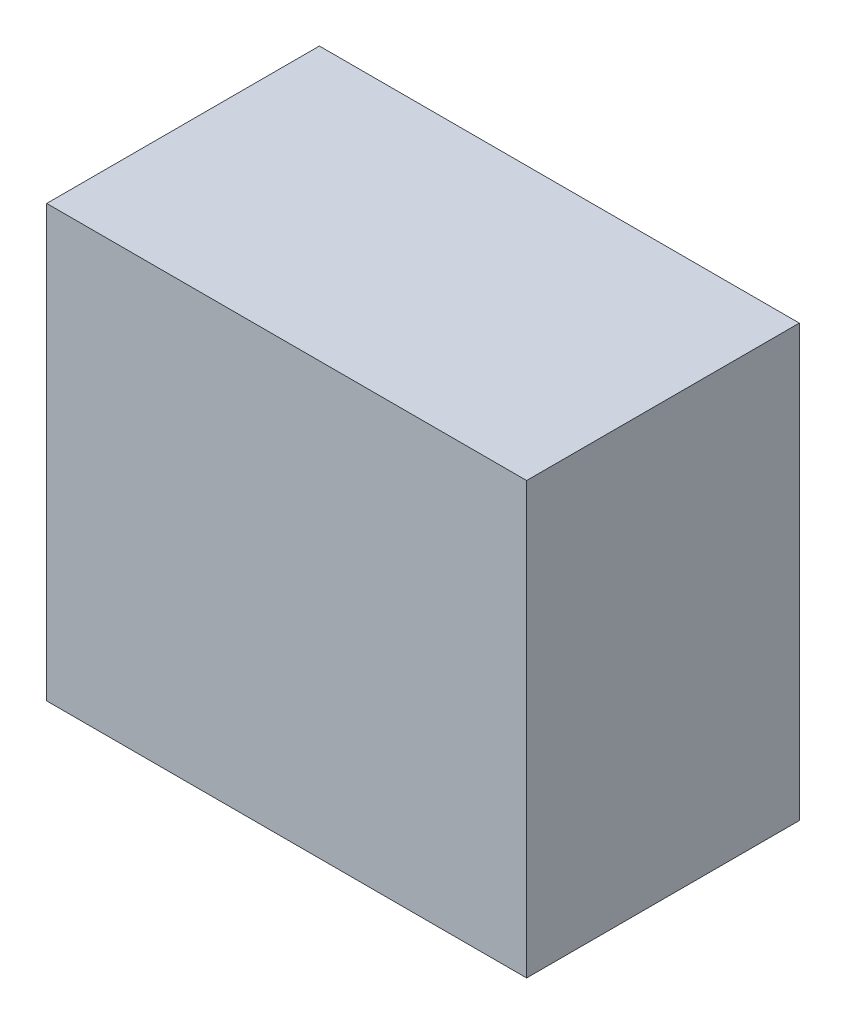
ISO-10303-21;
HEADER;
FILE_DESCRIPTION(('STEP AP214'),'2;1');
FILE_NAME('part.step','',(''),(''),'','','');
FILE_SCHEMA(('AUTOMOTIVE_DESIGN { 1 0 10303 214 1 1 1 1 }'));
ENDSEC;
DATA;
#1=APPLICATION_CONTEXT('core data for automotive mechanical design processes');
#2=APPLICATION_PROTOCOL_DEFINITION('international standard','automotive_design',2000,#1);
#3=PRODUCT_CONTEXT('',#1,'mechanical');
#4=PRODUCT('Part','Part','',(#3));
#5=PRODUCT_RELATED_PRODUCT_CATEGORY('part','',(#4));
#6=PRODUCT_DEFINITION_FORMATION('','',#4);
#7=PRODUCT_DEFINITION_CONTEXT('part definition',#1,'design');
#8=PRODUCT_DEFINITION('design','',#6,#7);
#9=PRODUCT_DEFINITION_SHAPE('','',#8);
#10=(LENGTH_UNIT() NAMED_UNIT(*) SI_UNIT(.MILLI.,.METRE.));
#11=(NAMED_UNIT(*) PLANE_ANGLE_UNIT() SI_UNIT($,.RADIAN.));
#12=(NAMED_UNIT(*) SI_UNIT($,.STERADIAN.) SOLID_ANGLE_UNIT());
#13=UNCERTAINTY_MEASURE_WITH_UNIT(LENGTH_MEASURE(1.E-05),#10,'distance_accuracy_value','');
#14=(GEOMETRIC_REPRESENTATION_CONTEXT(3) GLOBAL_UNCERTAINTY_ASSIGNED_CONTEXT((#13)) GLOBAL_UNIT_ASSIGNED_CONTEXT((#10,
#11,#12)) REPRESENTATION_CONTEXT('',''));
#15=CARTESIAN_POINT('',(0.,0.,0.));
#16=DIRECTION('',(0.,0.,1.));
#17=DIRECTION('',(1.,0.,0.));
#18=AXIS2_PLACEMENT_3D('',#15,#16,#17);
#19=CARTESIAN_POINT('',(11.176,-10.033,6.35));
#20=DIRECTION('',(-1.,0.,0.));
#21=DIRECTION('',(0.,0.,1.));
#22=AXIS2_PLACEMENT_3D('',#19,#20,#21);
#23=PLANE('',#22);
#24=DIRECTION('',(0.,1.,0.));
#25=VECTOR('',#24,1.);
#26=CARTESIAN_POINT('',(11.176,-10.033,-6.35));
#27=LINE('',#26,#25);
#28=CARTESIAN_POINT('',(11.176,-10.033,-6.35));
#29=VERTEX_POINT('',#28);
#30=CARTESIAN_POINT('',(11.176,10.033,-6.35));
#31=VERTEX_POINT('',#30);
#32=EDGE_CURVE('E94',#29,#31,#27,.T.);
#33=ORIENTED_EDGE('',*,*,#32,.T.);
#34=DIRECTION('',(0.,0.,-1.));
#35=VECTOR('',#34,1.);
#36=CARTESIAN_POINT('',(11.176,10.033,6.35));
#37=LINE('',#36,#35);
#38=CARTESIAN_POINT('',(11.176,10.033,6.35));
#39=VERTEX_POINT('',#38);
#40=EDGE_CURVE('E11',#39,#31,#37,.T.);
#41=ORIENTED_EDGE('',*,*,#40,.F.);
#42=DIRECTION('',(0.,1.,0.));
#43=VECTOR('',#42,1.);
#44=CARTESIAN_POINT('',(11.176,-10.033,6.35));
#45=LINE('',#44,#43);
#46=CARTESIAN_POINT('',(11.176,-10.033,6.35));
#47=VERTEX_POINT('',#46);
#48=EDGE_CURVE('E82',#47,#39,#45,.T.);
#49=ORIENTED_EDGE('',*,*,#48,.F.);
#50=DIRECTION('',(0.,0.,-1.));
#51=VECTOR('',#50,1.);
#52=CARTESIAN_POINT('',(11.176,-10.033,6.35));
#53=LINE('',#52,#51);
#54=EDGE_CURVE('E90',#47,#29,#53,.T.);
#55=ORIENTED_EDGE('',*,*,#54,.T.);
#56=EDGE_LOOP('',(#33,#41,#49,#55));
#57=FACE_BOUND('',#56,.T.);
#58=ADVANCED_FACE('F31',(#57),#23,.F.);
#59=CARTESIAN_POINT('',(-11.176,10.033,6.35));
#60=DIRECTION('',(0.,-1.,0.));
#61=DIRECTION('',(0.,0.,-1.));
#62=AXIS2_PLACEMENT_3D('',#59,#60,#61);
#63=PLANE('',#62);
#64=DIRECTION('',(-1.,0.,0.));
#65=VECTOR('',#64,1.);
#66=CARTESIAN_POINT('',(-11.176,10.033,-6.35));
#67=LINE('',#66,#65);
#68=CARTESIAN_POINT('',(-11.176,10.033,-6.35));
#69=VERTEX_POINT('',#68);
#70=EDGE_CURVE('E86',#31,#69,#67,.T.);
#71=ORIENTED_EDGE('',*,*,#70,.T.);
#72=DIRECTION('',(0.,0.,-1.));
#73=VECTOR('',#72,1.);
#74=CARTESIAN_POINT('',(-11.176,10.033,6.35));
#75=LINE('',#74,#73);
#76=CARTESIAN_POINT('',(-11.176,10.033,6.35));
#77=VERTEX_POINT('',#76);
#78=EDGE_CURVE('E39',#77,#69,#75,.T.);
#79=ORIENTED_EDGE('',*,*,#78,.F.);
#80=DIRECTION('',(-1.,0.,0.));
#81=VECTOR('',#80,1.);
#82=CARTESIAN_POINT('',(-11.176,10.033,6.35));
#83=LINE('',#82,#81);
#84=EDGE_CURVE('E77',#39,#77,#83,.T.);
#85=ORIENTED_EDGE('',*,*,#84,.F.);
#86=ORIENTED_EDGE('',*,*,#40,.T.);
#87=EDGE_LOOP('',(#71,#79,#85,#86));
#88=FACE_BOUND('',#87,.T.);
#89=ADVANCED_FACE('F85',(#88),#63,.F.);
#90=CARTESIAN_POINT('',(-11.176,-10.033,6.35));
#91=DIRECTION('',(1.,0.,0.));
#92=DIRECTION('',(0.,0.,-1.));
#93=AXIS2_PLACEMENT_3D('',#90,#91,#92);
#94=PLANE('',#93);
#95=DIRECTION('',(0.,-1.,0.));
#96=VECTOR('',#95,1.);
#97=CARTESIAN_POINT('',(-11.176,-10.033,-6.35));
#98=LINE('',#97,#96);
#99=CARTESIAN_POINT('',(-11.176,-10.033,-6.35));
#100=VERTEX_POINT('',#99);
#101=EDGE_CURVE('E64',#69,#100,#98,.T.);
#102=ORIENTED_EDGE('',*,*,#101,.T.);
#103=DIRECTION('',(0.,0.,-1.));
#104=VECTOR('',#103,1.);
#105=CARTESIAN_POINT('',(-11.176,-10.033,6.35));
#106=LINE('',#105,#104);
#107=CARTESIAN_POINT('',(-11.176,-10.033,6.35));
#108=VERTEX_POINT('',#107);
#109=EDGE_CURVE('E87',#108,#100,#106,.T.);
#110=ORIENTED_EDGE('',*,*,#109,.F.);
#111=DIRECTION('',(0.,-1.,0.));
#112=VECTOR('',#111,1.);
#113=CARTESIAN_POINT('',(-11.176,-10.033,6.35));
#114=LINE('',#113,#112);
#115=EDGE_CURVE('E80',#77,#108,#114,.T.);
#116=ORIENTED_EDGE('',*,*,#115,.F.);
#117=ORIENTED_EDGE('',*,*,#78,.T.);
#118=EDGE_LOOP('',(#102,#110,#116,#117));
#119=FACE_BOUND('',#118,.T.);
#120=ADVANCED_FACE('F88',(#119),#94,.F.);
#121=CARTESIAN_POINT('',(-11.176,-10.033,6.35));
#122=DIRECTION('',(0.,1.,0.));
#123=DIRECTION('',(0.,0.,1.));
#124=AXIS2_PLACEMENT_3D('',#121,#122,#123);
#125=PLANE('',#124);
#126=CARTESIAN_POINT('',(0.,-10.033,0.));
#127=DIRECTION('',(0.,-1.,0.));
#128=DIRECTION('',(0.,0.,-1.));
#129=AXIS2_PLACEMENT_3D('',#126,#127,#128);
#130=CIRCLE('',#129,2.38125);
#131=CARTESIAN_POINT('',(0.,-10.033,-2.38125));
#132=VERTEX_POINT('',#131);
#133=EDGE_CURVE('E108',#132,#132,#130,.T.);
#134=ORIENTED_EDGE('',*,*,#133,.F.);
#135=EDGE_LOOP('',(#134));
#136=FACE_BOUND('',#135,.T.);
#137=DIRECTION('',(1.,0.,0.));
#138=VECTOR('',#137,1.);
#139=CARTESIAN_POINT('',(-11.176,-10.033,-6.35));
#140=LINE('',#139,#138);
#141=EDGE_CURVE('E70',#100,#29,#140,.T.);
#142=ORIENTED_EDGE('',*,*,#141,.T.);
#143=ORIENTED_EDGE('',*,*,#54,.F.);
#144=DIRECTION('',(1.,0.,0.));
#145=VECTOR('',#144,1.);
#146=CARTESIAN_POINT('',(-11.176,-10.033,6.35));
#147=LINE('',#146,#145);
#148=EDGE_CURVE('E47',#108,#47,#147,.T.);
#149=ORIENTED_EDGE('',*,*,#148,.F.);
#150=ORIENTED_EDGE('',*,*,#109,.T.);
#151=EDGE_LOOP('',(#142,#143,#149,#150));
#152=FACE_BOUND('',#151,.T.);
#153=ADVANCED_FACE('F102',(#136,#152),#125,.F.);
#154=CARTESIAN_POINT('',(11.176,10.033,6.35));
#155=DIRECTION('',(0.,0.,-1.));
#156=DIRECTION('',(-1.,0.,0.));
#157=AXIS2_PLACEMENT_3D('',#154,#155,#156);
#158=PLANE('',#157);
#159=ORIENTED_EDGE('',*,*,#48,.T.);
#160=ORIENTED_EDGE('',*,*,#84,.T.);
#161=ORIENTED_EDGE('',*,*,#115,.T.);
#162=ORIENTED_EDGE('',*,*,#148,.T.);
#163=EDGE_LOOP('',(#159,#160,#161,#162));
#164=FACE_BOUND('',#163,.T.);
#165=ADVANCED_FACE('F78',(#164),#158,.F.);
#166=CARTESIAN_POINT('',(11.176,10.033,-6.35));
#167=DIRECTION('',(0.,0.,-1.));
#168=DIRECTION('',(-1.,0.,0.));
#169=AXIS2_PLACEMENT_3D('',#166,#167,#168);
#170=PLANE('',#169);
#171=ORIENTED_EDGE('',*,*,#32,.F.);
#172=ORIENTED_EDGE('',*,*,#141,.F.);
#173=ORIENTED_EDGE('',*,*,#101,.F.);
#174=ORIENTED_EDGE('',*,*,#70,.F.);
#175=EDGE_LOOP('',(#171,#172,#173,#174));
#176=FACE_BOUND('',#175,.T.);
#177=ADVANCED_FACE('F105',(#176),#170,.T.);
#178=CARTESIAN_POINT('',(0.,2.667,0.));
#179=DIRECTION('',(0.,-1.,0.));
#180=DIRECTION('',(0.,0.,-1.));
#181=AXIS2_PLACEMENT_3D('',#178,#179,#180);
#182=CYLINDRICAL_SURFACE('',#181,2.38125);
#183=CARTESIAN_POINT('',(0.,2.667,0.));
#184=DIRECTION('',(0.,-1.,0.));
#185=DIRECTION('',(0.,0.,-1.));
#186=AXIS2_PLACEMENT_3D('',#183,#184,#185);
#187=CIRCLE('',#186,2.38125);
#188=CARTESIAN_POINT('',(0.,2.667,-2.38125));
#189=VERTEX_POINT('',#188);
#190=EDGE_CURVE('E97',#189,#189,#187,.T.);
#191=ORIENTED_EDGE('',*,*,#190,.F.);
#192=EDGE_LOOP('',(#191));
#193=FACE_BOUND('',#192,.T.);
#194=ORIENTED_EDGE('',*,*,#133,.T.);
#195=EDGE_LOOP('',(#194));
#196=FACE_BOUND('',#195,.T.);
#197=ADVANCED_FACE('F116',(#193,#196),#182,.F.);
#198=CARTESIAN_POINT('',(0.,2.667,0.));
#199=DIRECTION('',(0.,-1.,0.));
#200=DIRECTION('',(0.,0.,-1.));
#201=AXIS2_PLACEMENT_3D('',#198,#199,#200);
#202=PLANE('',#201);
#203=ORIENTED_EDGE('',*,*,#190,.T.);
#204=EDGE_LOOP('',(#203));
#205=FACE_BOUND('',#204,.T.);
#206=ADVANCED_FACE('F114',(#205),#202,.T.);
#207=CLOSED_SHELL('',(#58,#89,#120,#153,#165,#177,#197,#206));
#208=MANIFOLD_SOLID_BREP('B2',#207);
#209=ADVANCED_BREP_SHAPE_REPRESENTATION('',(#18,#208),#14);
#210=SHAPE_DEFINITION_REPRESENTATION(#9,#209);
ENDSEC;
END-ISO-10303-21;
